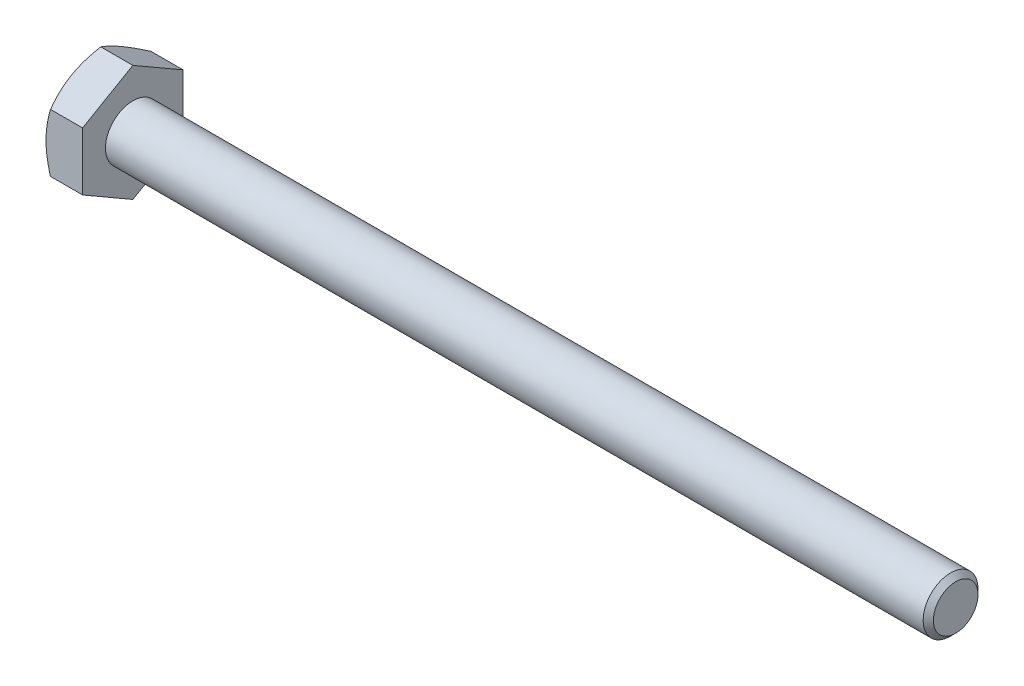
ISO-10303-21;
HEADER;
FILE_DESCRIPTION(('STEP AP214'),'2;1');
FILE_NAME('part.step','',(''),(''),'','','');
FILE_SCHEMA(('AUTOMOTIVE_DESIGN { 1 0 10303 214 1 1 1 1 }'));
ENDSEC;
DATA;
#1=APPLICATION_CONTEXT('core data for automotive mechanical design processes');
#2=APPLICATION_PROTOCOL_DEFINITION('international standard','automotive_design',2000,#1);
#3=PRODUCT_CONTEXT('',#1,'mechanical');
#4=PRODUCT('Part','Part','',(#3));
#5=PRODUCT_RELATED_PRODUCT_CATEGORY('part','',(#4));
#6=PRODUCT_DEFINITION_FORMATION('','',#4);
#7=PRODUCT_DEFINITION_CONTEXT('part definition',#1,'design');
#8=PRODUCT_DEFINITION('design','',#6,#7);
#9=PRODUCT_DEFINITION_SHAPE('','',#8);
#10=(LENGTH_UNIT() NAMED_UNIT(*) SI_UNIT(.MILLI.,.METRE.));
#11=(NAMED_UNIT(*) PLANE_ANGLE_UNIT() SI_UNIT($,.RADIAN.));
#12=(NAMED_UNIT(*) SI_UNIT($,.STERADIAN.) SOLID_ANGLE_UNIT());
#13=UNCERTAINTY_MEASURE_WITH_UNIT(LENGTH_MEASURE(1.E-05),#10,'distance_accuracy_value','');
#14=(GEOMETRIC_REPRESENTATION_CONTEXT(3) GLOBAL_UNCERTAINTY_ASSIGNED_CONTEXT((#13)) GLOBAL_UNIT_ASSIGNED_CONTEXT((#10,
#11,#12)) REPRESENTATION_CONTEXT('',''));
#15=CARTESIAN_POINT('',(0.,0.,0.));
#16=DIRECTION('',(0.,0.,1.));
#17=DIRECTION('',(1.,0.,0.));
#18=AXIS2_PLACEMENT_3D('',#15,#16,#17);
#19=CARTESIAN_POINT('',(0.247093813584343,0.,0.));
#20=DIRECTION('',(1.,0.,0.));
#21=DIRECTION('',(0.,0.,-1.));
#22=AXIS2_PLACEMENT_3D('',#19,#20,#21);
#23=CONICAL_SURFACE('',#22,3.17797903937844,1.04719755121946);
#24=CARTESIAN_POINT('',(0.24562010267378,1.58771322360887,2.75000002886048));
#25=CARTESIAN_POINT('',(0.208302603654191,1.65233281555866,2.63807561243907));
#26=CARTESIAN_POINT('',(0.174113259321967,1.7174699044324,2.52525486505261));
#27=CARTESIAN_POINT('',(0.113820966108115,1.8483182591926,2.29861886652116));
#28=CARTESIAN_POINT('',(0.087678031758483,1.91402496097017,2.18481152064462));
#29=CARTESIAN_POINT('',(0.0555789468438281,2.01320512545803,2.01302643664861));
#30=CARTESIAN_POINT('',(0.046061241370184,2.04639046606418,1.95554774065228));
#31=CARTESIAN_POINT('',(0.0295858947880669,2.1129200190349,1.84031517470215));
#32=CARTESIAN_POINT('',(0.0226281862985192,2.14626422719456,1.78256131203147));
#33=CARTESIAN_POINT('',(0.0113950805088262,2.2132348513754,1.66656478833565));
#34=CARTESIAN_POINT('',(0.00713332390408386,2.24686184378969,1.60832112896836));
#35=CARTESIAN_POINT('',(0.00142988482438796,2.31418196202442,1.49171926381427));
#36=CARTESIAN_POINT('',(-1.12391437539125E-05,2.34787509962031,1.43336103763178));
#37=CARTESIAN_POINT('',(4.72581289227276E-12,2.3815698604072,1.375));
#38=B_SPLINE_CURVE_WITH_KNOTS('',3,(#24,#25,#26,#27,#28,#29,#30,#31,#32,#33,#34,#35,#36,#37),
.UNSPECIFIED.,.F.,.F.,(4,2,2,2,2,2,4),(0.,0.403720170813952,0.805400455121433,1.00650414154214,
1.20760253438159,1.40971045256613,1.61185838561563),.UNSPECIFIED.);
#39=CARTESIAN_POINT('',(0.2456200978637,1.58771323194017,2.75000001443024));
#40=VERTEX_POINT('',#39);
#41=CARTESIAN_POINT('',(2.3630159899092E-12,2.38156986040366,1.37499999999796));
#42=VERTEX_POINT('',#41);
#43=EDGE_CURVE('E97',#40,#42,#38,.T.);
#44=ORIENTED_EDGE('',*,*,#43,.T.);
#45=CARTESIAN_POINT('',(0.,0.,0.));
#46=DIRECTION('',(1.,0.,0.));
#47=DIRECTION('',(0.,0.,-1.));
#48=AXIS2_PLACEMENT_3D('',#45,#46,#47);
#49=CIRCLE('',#48,2.74999999999181);
#50=CARTESIAN_POINT('',(2.36282788152752E-12,0.,2.74999999999591));
#51=VERTEX_POINT('',#50);
#52=EDGE_CURVE('E99',#42,#51,#49,.T.);
#53=ORIENTED_EDGE('',*,*,#52,.T.);
#54=CARTESIAN_POINT('',(4.72565576305503E-12,0.,2.75));
#55=CARTESIAN_POINT('',(-1.12391403169157E-05,0.0673895163245459,2.75));
#56=CARTESIAN_POINT('',(0.00142988460167275,0.134775786268303,2.75));
#57=CARTESIAN_POINT('',(0.00713332279565177,0.269416012274256,2.75));
#58=CARTESIAN_POINT('',(0.0113950787410856,0.336669991887335,2.75));
#59=CARTESIAN_POINT('',(0.022628182811776,0.470611229931942,2.75));
#60=CARTESIAN_POINT('',(0.029585890245106,0.537299641149282,2.75));
#61=CARTESIAN_POINT('',(0.0460612343572212,0.670358736954085,2.75));
#62=CARTESIAN_POINT('',(0.0555789384170422,0.736729413131717,2.75));
#63=CARTESIAN_POINT('',(0.0876780186410727,0.935089727173002,2.75));
#64=CARTESIAN_POINT('',(0.113820949258707,1.06650312094462,2.75));
#65=CARTESIAN_POINT('',(0.174113234142275,1.32819981107932,2.75));
#66=CARTESIAN_POINT('',(0.20830257386764,1.45847397922719,2.75));
#67=CARTESIAN_POINT('',(0.245620068055921,1.58771315367689,2.75));
#68=B_SPLINE_CURVE_WITH_KNOTS('',3,(#54,#55,#56,#57,#58,#59,#60,#61,#62,#63,#64,#65,#66,#67),
.UNSPECIFIED.,.F.,.F.,(4,2,2,2,2,2,4),(0.,0.202147917307363,0.404255819765089,0.60535419706349,
0.806457867940412,1.2081381213207,1.61185826082873),.UNSPECIFIED.);
#69=EDGE_CURVE('E20',#51,#40,#68,.T.);
#70=ORIENTED_EDGE('',*,*,#69,.T.);
#71=EDGE_LOOP('',(#44,#53,#70));
#72=FACE_BOUND('',#71,.T.);
#73=ADVANCED_FACE('F16',(#72),#23,.T.);
#74=CARTESIAN_POINT('',(0.247093813584343,0.,0.));
#75=DIRECTION('',(1.,0.,0.));
#76=DIRECTION('',(0.,0.,-1.));
#77=AXIS2_PLACEMENT_3D('',#74,#75,#76);
#78=CONICAL_SURFACE('',#77,3.17797903937844,1.04719755121946);
#79=CARTESIAN_POINT('',(0.,0.,0.));
#80=DIRECTION('',(1.,0.,0.));
#81=DIRECTION('',(0.,0.,-1.));
#82=AXIS2_PLACEMENT_3D('',#79,#80,#81);
#83=CIRCLE('',#82,2.74999999999181);
#84=CARTESIAN_POINT('',(2.36464317833425E-12,-2.38156986040366,1.37499999999796));
#85=VERTEX_POINT('',#84);
#86=EDGE_CURVE('E105',#51,#85,#83,.T.);
#87=ORIENTED_EDGE('',*,*,#86,.T.);
#88=CARTESIAN_POINT('',(4.72922376022689E-12,-2.38156986040721,1.37500000000001));
#89=CARTESIAN_POINT('',(-1.12391437503857E-05,-2.34787509962045,1.43336103763155));
#90=CARTESIAN_POINT('',(0.0014298848243798,-2.3141819620247,1.4917192638138));
#91=CARTESIAN_POINT('',(0.00713332390402984,-2.24686184379024,1.60832112896742));
#92=CARTESIAN_POINT('',(0.011395080508738,-2.21323485137609,1.66656478833447));
#93=CARTESIAN_POINT('',(0.0226281862983418,-2.14626422719551,1.78256131202983));
#94=CARTESIAN_POINT('',(0.0295858947878346,-2.11292001903599,1.84031517470028));
#95=CARTESIAN_POINT('',(0.0460612413698236,-2.04639046606553,1.95554774064996));
#96=CARTESIAN_POINT('',(0.0555789468433946,-2.01320512545951,2.01302643664606));
#97=CARTESIAN_POINT('',(0.0876780317578065,-1.91402496097204,2.1848115206414));
#98=CARTESIAN_POINT('',(0.113820966107245,-1.84831825919471,2.2986188665175));
#99=CARTESIAN_POINT('',(0.174113259320664,-1.71746990443502,2.52525486504808));
#100=CARTESIAN_POINT('',(0.208302603652649,-1.65233281556153,2.63807561243411));
#101=CARTESIAN_POINT('',(0.245620102671988,-1.58771322361198,2.75000002885509));
#102=B_SPLINE_CURVE_WITH_KNOTS('',3,(#88,#89,#90,#91,#92,#93,#94,#95,#96,#97,#98,#99,#100,#101),
.UNSPECIFIED.,.F.,.F.,(4,2,2,2,2,2,4),(0.,0.202147933048678,0.404255851232406,0.60535424407105,
0.806457930490951,1.20813821479683,1.61185838560916),.UNSPECIFIED.);
#103=CARTESIAN_POINT('',(0.245620080547694,-1.58771319694967,2.75));
#104=VERTEX_POINT('',#103);
#105=EDGE_CURVE('E113',#85,#104,#102,.T.);
#106=ORIENTED_EDGE('',*,*,#105,.T.);
#107=CARTESIAN_POINT('',(0.245620068041765,-1.58771315362786,2.75));
#108=CARTESIAN_POINT('',(0.20830257385546,-1.45847397918202,2.75));
#109=CARTESIAN_POINT('',(0.174113234131979,-1.32819981103807,2.75));
#110=CARTESIAN_POINT('',(0.113820949251817,-1.0665031209113,2.75));
#111=CARTESIAN_POINT('',(0.0876780186357089,-0.935089727143683,2.75));
#112=CARTESIAN_POINT('',(0.0555789384135963,-0.736729413108504,2.75));
#113=CARTESIAN_POINT('',(0.0460612343543534,-0.670358736932932,2.75));
#114=CARTESIAN_POINT('',(0.0295858902432482,-0.537299641132273,2.75));
#115=CARTESIAN_POINT('',(0.0226281828103503,-0.470611229917019,2.75));
#116=CARTESIAN_POINT('',(0.0113950787403629,-0.336669991876632,2.75));
#117=CARTESIAN_POINT('',(0.00713332279519862,-0.269416012265686,2.75));
#118=CARTESIAN_POINT('',(0.00142988460158163,-0.134775786264011,2.75));
#119=CARTESIAN_POINT('',(-1.12391403156188E-05,-0.0673895163223995,2.75));
#120=CARTESIAN_POINT('',(4.72564427270851E-12,0.,2.75));
#121=B_SPLINE_CURVE_WITH_KNOTS('',3,(#107,#108,#109,#110,#111,#112,#113,#114,#115,#116,#117,
#118,#119,#120),.UNSPECIFIED.,.F.,.F.,(4,2,2,2,2,2,4),(0.,0.403720139495227,0.805400392862871,
1.00650406373344,1.20760244102548,1.40971034347678,1.6118582607777),.UNSPECIFIED.);
#122=EDGE_CURVE('E92',#104,#51,#121,.T.);
#123=ORIENTED_EDGE('',*,*,#122,.T.);
#124=EDGE_LOOP('',(#87,#106,#123));
#125=FACE_BOUND('',#124,.T.);
#126=ADVANCED_FACE('F111',(#125),#78,.T.);
#127=CARTESIAN_POINT('',(0.247093813584343,0.,0.));
#128=DIRECTION('',(1.,0.,0.));
#129=DIRECTION('',(0.,0.,-1.));
#130=AXIS2_PLACEMENT_3D('',#127,#128,#129);
#131=CONICAL_SURFACE('',#130,3.17797903937844,1.04719755121946);
#132=CARTESIAN_POINT('',(0.,0.,0.));
#133=DIRECTION('',(1.,0.,0.));
#134=DIRECTION('',(0.,0.,-1.));
#135=AXIS2_PLACEMENT_3D('',#132,#133,#134);
#136=CIRCLE('',#135,2.74999999999181);
#137=CARTESIAN_POINT('',(2.36464430188982E-12,-2.38156986040366,-1.37499999999796));
#138=VERTEX_POINT('',#137);
#139=EDGE_CURVE('E119',#85,#138,#136,.T.);
#140=ORIENTED_EDGE('',*,*,#139,.T.);
#141=CARTESIAN_POINT('',(4.72928860377965E-12,-2.38156986040721,-1.37500000000001));
#142=CARTESIAN_POINT('',(-1.12391437501949E-05,-2.41526462119399,-1.31663896236842));
#143=CARTESIAN_POINT('',(0.00142988482438192,-2.44895775878977,-1.25828073618613));
#144=CARTESIAN_POINT('',(0.00713332390403964,-2.51627787702427,-1.14167887103242));
#145=CARTESIAN_POINT('',(0.0113950805087536,-2.54990486943845,-1.08343521166534));
#146=CARTESIAN_POINT('',(0.0226281862983728,-2.61687549361907,-0.967438687969894));
#147=CARTESIAN_POINT('',(0.0295858947878753,-2.65021970177862,-0.909684825299408));
#148=CARTESIAN_POINT('',(0.0460612413698864,-2.71674925474912,-0.794452259349648));
#149=CARTESIAN_POINT('',(0.0555789468434698,-2.74993459535516,-0.736973563353507));
#150=CARTESIAN_POINT('',(0.0876780317579234,-2.8491147598427,-0.565188479358052));
#151=CARTESIAN_POINT('',(0.113820966107395,-2.91482146162007,-0.451381133481875));
#152=CARTESIAN_POINT('',(0.17411325932089,-3.04566981637985,-0.224745134951144));
#153=CARTESIAN_POINT('',(0.208302603652916,-3.11080690525339,-0.111924387565041));
#154=CARTESIAN_POINT('',(0.245620102672298,-3.17542649720298,2.88560130651261E-08));
#155=B_SPLINE_CURVE_WITH_KNOTS('',3,(#141,#142,#143,#144,#145,#146,#147,#148,#149,#150,#151,
#152,#153,#154),.UNSPECIFIED.,.F.,.F.,(4,2,2,2,2,2,4),(0.,0.202147933048819,0.404255851232687,
0.605354244071471,0.806457930491512,1.20813821479767,1.61185838561028),.UNSPECIFIED.);
#156=CARTESIAN_POINT('',(0.245620080547544,-3.17542645888178,3.75182486861286E-08));
#157=VERTEX_POINT('',#156);
#158=EDGE_CURVE('E173',#138,#157,#155,.T.);
#159=ORIENTED_EDGE('',*,*,#158,.T.);
#160=CARTESIAN_POINT('',(0.245620068041461,-3.17542643722061,7.50364969385818E-08));
#161=CARTESIAN_POINT('',(0.208302573855199,-3.11080684999773,0.111924483270649));
#162=CARTESIAN_POINT('',(0.174113234131759,-3.0456697659258,0.224745222340119));
#163=CARTESIAN_POINT('',(0.11382094925167,-2.9148214208625,0.451381204076056));
#164=CARTESIAN_POINT('',(0.0876780186355958,-2.84911472397873,0.565188541476268));
#165=CARTESIAN_POINT('',(0.0555789384135252,-2.74993456696121,0.736973612533276));
#166=CARTESIAN_POINT('',(0.0460612343542949,-2.71674922887345,0.794452304167634));
#167=CARTESIAN_POINT('',(0.0295858902432116,-2.65021968097316,0.909684861335514));
#168=CARTESIAN_POINT('',(0.0226281828103228,-2.61687547536556,0.967438719585908));
#169=CARTESIAN_POINT('',(0.0113950787403507,-2.54990485634541,1.08343523434314));
#170=CARTESIAN_POINT('',(0.00713332279519246,-2.51627786653996,1.14167888919178));
#171=CARTESIAN_POINT('',(0.0014298846015836,-2.44895775353917,1.25828074528043));
#172=CARTESIAN_POINT('',(-1.12391403115827E-05,-2.41526461856839,1.3166389669161));
#173=CARTESIAN_POINT('',(4.72934450508175E-12,-2.38156986040721,1.37500000000001));
#174=B_SPLINE_CURVE_WITH_KNOTS('',3,(#160,#161,#162,#163,#164,#165,#166,#167,#168,#169,#170,
#171,#172,#173),.UNSPECIFIED.,.F.,.F.,(4,2,2,2,2,2,4),(0.,0.40372013949495,0.805400392862319,
1.00650406373275,1.20760244102465,1.40971034347581,1.6118582607766),.UNSPECIFIED.);
#175=EDGE_CURVE('E191',#157,#85,#174,.T.);
#176=ORIENTED_EDGE('',*,*,#175,.T.);
#177=EDGE_LOOP('',(#140,#159,#176));
#178=FACE_BOUND('',#177,.T.);
#179=ADVANCED_FACE('F156',(#178),#131,.T.);
#180=CARTESIAN_POINT('',(0.247093813584343,0.,0.));
#181=DIRECTION('',(1.,0.,0.));
#182=DIRECTION('',(0.,0.,-1.));
#183=AXIS2_PLACEMENT_3D('',#180,#181,#182);
#184=CONICAL_SURFACE('',#183,3.17797903937844,1.04719755121946);
#185=CARTESIAN_POINT('',(0.,0.,0.));
#186=DIRECTION('',(1.,0.,0.));
#187=DIRECTION('',(0.,0.,-1.));
#188=AXIS2_PLACEMENT_3D('',#185,#186,#187);
#189=CIRCLE('',#188,2.74999999999181);
#190=CARTESIAN_POINT('',(2.36301567085236E-12,0.,-2.74999999999591));
#191=VERTEX_POINT('',#190);
#192=EDGE_CURVE('E121',#138,#191,#189,.T.);
#193=ORIENTED_EDGE('',*,*,#192,.T.);
#194=CARTESIAN_POINT('',(4.72603134170472E-12,0.,-2.75));
#195=CARTESIAN_POINT('',(-1.12391437535286E-05,-0.0673895215734155,-2.75));
#196=CARTESIAN_POINT('',(0.00142988482437251,-0.134775796764826,-2.75));
#197=CARTESIAN_POINT('',(0.00713332390400646,-0.269416033233554,-2.75));
#198=CARTESIAN_POINT('',(0.0113950805087027,-0.336670018061767,-2.75));
#199=CARTESIAN_POINT('',(0.0226281862982756,-0.470611266422736,-2.75));
#200=CARTESIAN_POINT('',(0.0295858947877495,-0.537299682741689,-2.75));
#201=CARTESIAN_POINT('',(0.0460612413696938,-0.670358788682425,-2.75));
#202=CARTESIAN_POINT('',(0.055578946843239,-0.73672946989437,-2.75));
#203=CARTESIAN_POINT('',(0.0876780317575655,-0.935089798869043,-2.75));
#204=CARTESIAN_POINT('',(0.113820966106936,-1.06650320242351,-2.75));
#205=CARTESIAN_POINT('',(0.174113259320205,-1.32819991194254,-2.75));
#206=CARTESIAN_POINT('',(0.208302603652107,-1.45847408968937,-2.75));
#207=CARTESIAN_POINT('',(0.245620102671358,-1.58771327358829,-2.75));
#208=B_SPLINE_CURVE_WITH_KNOTS('',3,(#194,#195,#196,#197,#198,#199,#200,#201,#202,#203,#204,
#205,#206,#207),.UNSPECIFIED.,.F.,.F.,(4,2,2,2,2,2,4),(0.,0.202147933048393,0.404255851231836,
0.605354244070199,0.806457930489819,1.20813821479514,1.6118583856069),.UNSPECIFIED.);
#209=CARTESIAN_POINT('',(0.245620080548032,-1.58771326193192,-2.74999996248315));
#210=VERTEX_POINT('',#209);
#211=EDGE_CURVE('E160',#191,#210,#208,.T.);
#212=ORIENTED_EDGE('',*,*,#211,.T.);
#213=CARTESIAN_POINT('',(0.245620068042392,-1.5877132835922,-2.74999992496631));
#214=CARTESIAN_POINT('',(0.208302573856,-1.6523328708152,-2.63807551673193));
#215=CARTESIAN_POINT('',(0.174113234132436,-1.71746995488726,-2.52525477766224));
#216=CARTESIAN_POINT('',(0.113820949252124,-1.84831829995082,-2.29861879592585));
#217=CARTESIAN_POINT('',(0.0876780186359484,-1.91402499683472,-2.18481145852541));
#218=CARTESIAN_POINT('',(0.0555789384137517,-2.01320515385245,-2.01302638746806));
#219=CARTESIAN_POINT('',(0.0460612343544835,-2.04639049194028,-1.95554769583358));
#220=CARTESIAN_POINT('',(0.0295858902433337,-2.1129200398407,-1.84031513866546));
#221=CARTESIAN_POINT('',(0.0226281828104164,-2.14626424544837,-1.78256128041495));
#222=CARTESIAN_POINT('',(0.0113950787403979,-2.21323486446866,-1.66656476565748));
#223=CARTESIAN_POINT('',(0.00713332279522201,-2.24686185427418,-1.60832111080872));
#224=CARTESIAN_POINT('',(0.00142988460158942,-2.31418196727511,-1.49171925471982));
#225=CARTESIAN_POINT('',(-1.12391403117872E-05,-2.34787510224596,-1.43336103308403));
#226=CARTESIAN_POINT('',(4.72923002787203E-12,-2.38156986040721,-1.375));
#227=B_SPLINE_CURVE_WITH_KNOTS('',3,(#213,#214,#215,#216,#217,#218,#219,#220,#221,#222,#223,
#224,#225,#226),.UNSPECIFIED.,.F.,.F.,(4,2,2,2,2,2,4),(0.,0.403720139495791,0.805400392863992,
1.00650406373484,1.20760244102716,1.40971034347874,1.61185826077995),.UNSPECIFIED.);
#228=EDGE_CURVE('E166',#210,#138,#227,.T.);
#229=ORIENTED_EDGE('',*,*,#228,.T.);
#230=EDGE_LOOP('',(#193,#212,#229));
#231=FACE_BOUND('',#230,.T.);
#232=ADVANCED_FACE('F149',(#231),#184,.T.);
#233=CARTESIAN_POINT('',(0.247093813584343,0.,0.));
#234=DIRECTION('',(1.,0.,0.));
#235=DIRECTION('',(0.,0.,-1.));
#236=AXIS2_PLACEMENT_3D('',#233,#234,#235);
#237=CONICAL_SURFACE('',#236,3.17797903937844,1.04719755121946);
#238=CARTESIAN_POINT('',(0.245620102671646,1.58771327358929,-2.75));
#239=CARTESIAN_POINT('',(0.208302603652355,1.45847408969029,-2.75));
#240=CARTESIAN_POINT('',(0.174113259320415,1.32819991194339,-2.75));
#241=CARTESIAN_POINT('',(0.113820966107077,1.06650320242419,-2.75));
#242=CARTESIAN_POINT('',(0.0876780317576748,0.935089798869642,-2.75));
#243=CARTESIAN_POINT('',(0.0555789468433089,0.736729469894844,-2.75));
#244=CARTESIAN_POINT('',(0.046061241369752,0.670358788682857,-2.75));
#245=CARTESIAN_POINT('',(0.029585894787787,0.537299682742037,-2.75));
#246=CARTESIAN_POINT('',(0.0226281862983043,0.470611266423041,-2.75));
#247=CARTESIAN_POINT('',(0.0113950805087172,0.336670018061985,-2.75));
#248=CARTESIAN_POINT('',(0.00713332390401551,0.269416033233729,-2.75));
#249=CARTESIAN_POINT('',(0.00142988482437428,0.134775796764914,-2.75));
#250=CARTESIAN_POINT('',(-1.12391437535898E-05,0.0673895215734597,-2.75));
#251=CARTESIAN_POINT('',(4.72603085714641E-12,0.,-2.75));
#252=B_SPLINE_CURVE_WITH_KNOTS('',3,(#238,#239,#240,#241,#242,#243,#244,#245,#246,#247,#248,
#249,#250,#251),.UNSPECIFIED.,.F.,.F.,(4,2,2,2,2,2,4),(0.,0.403720170812023,0.805400455117598,
1.00650414153735,1.20760253437584,1.40971045255941,1.61185838560794),.UNSPECIFIED.);
#253=CARTESIAN_POINT('',(0.245620097862634,1.58771325693038,-2.75));
#254=VERTEX_POINT('',#253);
#255=EDGE_CURVE('E106',#254,#191,#252,.T.);
#256=ORIENTED_EDGE('',*,*,#255,.T.);
#257=CARTESIAN_POINT('',(0.,0.,0.));
#258=DIRECTION('',(1.,0.,0.));
#259=DIRECTION('',(0.,0.,-1.));
#260=AXIS2_PLACEMENT_3D('',#257,#258,#259);
#261=CIRCLE('',#260,2.74999999999181);
#262=CARTESIAN_POINT('',(2.36298517466423E-12,2.38156986040366,-1.37499999999796));
#263=VERTEX_POINT('',#262);
#264=EDGE_CURVE('E341',#191,#263,#261,.T.);
#265=ORIENTED_EDGE('',*,*,#264,.T.);
#266=CARTESIAN_POINT('',(4.72615813865329E-12,2.3815698604072,-1.375));
#267=CARTESIAN_POINT('',(-1.12391403149998E-05,2.34787510224598,-1.43336103308399));
#268=CARTESIAN_POINT('',(0.00142988460158435,2.31418196727515,-1.49171925471975));
#269=CARTESIAN_POINT('',(0.00713332279520972,2.24686185427426,-1.60832111080856));
#270=CARTESIAN_POINT('',(0.0113950787403803,2.21323486446876,-1.66656476565729));
#271=CARTESIAN_POINT('',(0.0226281828103846,2.14626424544852,-1.78256128041469));
#272=CARTESIAN_POINT('',(0.0295858902432931,2.11292003984086,-1.84031513866517));
#273=CARTESIAN_POINT('',(0.0460612343544224,2.04639049194049,-1.95554769583321));
#274=CARTESIAN_POINT('',(0.055578938413679,2.01320515385268,-2.01302638746765));
#275=CARTESIAN_POINT('',(0.0876780186358369,1.91402499683501,-2.1848114585249));
#276=CARTESIAN_POINT('',(0.113820949251981,1.84831829995116,-2.29861879592527));
#277=CARTESIAN_POINT('',(0.174113234132225,1.71746995488768,-2.52525477766152));
#278=CARTESIAN_POINT('',(0.208302573855751,1.65233287081565,-2.63807551673114));
#279=CARTESIAN_POINT('',(0.245620068042103,1.58771328359269,-2.74999992496544));
#280=B_SPLINE_CURVE_WITH_KNOTS('',3,(#266,#267,#268,#269,#270,#271,#272,#273,#274,#275,#276,
#277,#278,#279),.UNSPECIFIED.,.F.,.F.,(4,2,2,2,2,2,4),(0.,0.202147917301079,0.404255819752529,
0.605354197044726,0.806457867915443,1.20813812128339,1.61185826077892),.UNSPECIFIED.);
#281=EDGE_CURVE('E133',#263,#254,#280,.T.);
#282=ORIENTED_EDGE('',*,*,#281,.T.);
#283=EDGE_LOOP('',(#256,#265,#282));
#284=FACE_BOUND('',#283,.T.);
#285=ADVANCED_FACE('F144',(#284),#237,.T.);
#286=CARTESIAN_POINT('',(0.,3.17542648054294,0.));
#287=DIRECTION('',(1.,0.,0.));
#288=DIRECTION('',(0.,0.,-1.));
#289=AXIS2_PLACEMENT_3D('',#286,#287,#288);
#290=PLANE('',#289);
#291=ORIENTED_EDGE('',*,*,#192,.F.);
#292=ORIENTED_EDGE('',*,*,#139,.F.);
#293=ORIENTED_EDGE('',*,*,#86,.F.);
#294=ORIENTED_EDGE('',*,*,#52,.F.);
#295=CARTESIAN_POINT('',(0.,0.,0.));
#296=DIRECTION('',(1.,0.,0.));
#297=DIRECTION('',(0.,0.,-1.));
#298=AXIS2_PLACEMENT_3D('',#295,#296,#297);
#299=CIRCLE('',#298,2.74999999999181);
#300=EDGE_CURVE('E342',#263,#42,#299,.T.);
#301=ORIENTED_EDGE('',*,*,#300,.F.);
#302=ORIENTED_EDGE('',*,*,#264,.F.);
#303=EDGE_LOOP('',(#291,#292,#293,#294,#301,#302));
#304=FACE_BOUND('',#303,.T.);
#305=ADVANCED_FACE('F117',(#304),#290,.F.);
#306=CARTESIAN_POINT('',(0.247093813584343,0.,0.));
#307=DIRECTION('',(1.,0.,0.));
#308=DIRECTION('',(0.,0.,-1.));
#309=AXIS2_PLACEMENT_3D('',#306,#307,#308);
#310=CONICAL_SURFACE('',#309,3.17797903937844,1.04719755121946);
#311=CARTESIAN_POINT('',(0.245620093054257,3.17542648054404,1.90076577879672E-12));
#312=CARTESIAN_POINT('',(0.208302595377179,3.1108068899072,-0.111924414145401));
#313=CARTESIAN_POINT('',(0.174113252325098,3.04566980236722,-0.224745159221722));
#314=CARTESIAN_POINT('',(0.113820961426044,2.91482145030045,-0.451381153088027));
#315=CARTESIAN_POINT('',(0.0876780281134501,2.84911474988218,-0.565188496610171));
#316=CARTESIAN_POINT('',(0.0555789445022141,2.74993458746929,-0.736973577012226));
#317=CARTESIAN_POINT('',(0.0460612394214395,2.71674924756265,-0.794452271796967));
#318=CARTESIAN_POINT('',(0.0295858935256803,2.6502196960003,-0.909684835307731));
#319=CARTESIAN_POINT('',(0.0226281853296317,2.61687548854951,-0.967438696750622));
#320=CARTESIAN_POINT('',(0.0113950800176109,2.54990486580211,-1.08343521796365));
#321=CARTESIAN_POINT('',(0.00713332359607554,2.51627787411245,-1.14167887607583));
#322=CARTESIAN_POINT('',(0.00142988476250048,2.44895775733151,-1.25828073871189));
#323=CARTESIAN_POINT('',(-1.12391427987271E-05,2.41526462046477,-1.31663896363145));
#324=CARTESIAN_POINT('',(4.72607735642762E-12,2.3815698604072,-1.375));
#325=B_SPLINE_CURVE_WITH_KNOTS('',3,(#311,#312,#313,#314,#315,#316,#317,#318,#319,#320,#321,
#322,#323,#324),.UNSPECIFIED.,.F.,.F.,(4,2,2,2,2,2,4),(0.,0.403720162114742,0.805400437828253,
1.00650411992969,1.20760250845064,1.40971042226505,1.61185835094016),.UNSPECIFIED.);
#326=CARTESIAN_POINT('',(0.245620093054257,3.17542648054404,0.));
#327=VERTEX_POINT('',#326);
#328=EDGE_CURVE('E256',#327,#263,#325,.T.);
#329=ORIENTED_EDGE('',*,*,#328,.T.);
#330=ORIENTED_EDGE('',*,*,#300,.T.);
#331=CARTESIAN_POINT('',(4.7258761186801E-12,2.3815698604072,1.375));
#332=CARTESIAN_POINT('',(-1.12391427987737E-05,2.41526462046477,1.31663896363145));
#333=CARTESIAN_POINT('',(0.00142988476250046,2.44895775733151,1.25828073871189));
#334=CARTESIAN_POINT('',(0.00713332359607553,2.51627787411245,1.14167887607583));
#335=CARTESIAN_POINT('',(0.0113950800176108,2.54990486580211,1.08343521796365));
#336=CARTESIAN_POINT('',(0.0226281853296318,2.61687548854951,0.967438696750622));
#337=CARTESIAN_POINT('',(0.0295858935256804,2.6502196960003,0.90968483530773));
#338=CARTESIAN_POINT('',(0.0460612394214397,2.71674924756265,0.794452271796966));
#339=CARTESIAN_POINT('',(0.0555789445022143,2.74993458746929,0.736973577012225));
#340=CARTESIAN_POINT('',(0.0876780281134504,2.84911474988218,0.565188496610171));
#341=CARTESIAN_POINT('',(0.113820961426044,2.91482145030045,0.451381153088027));
#342=CARTESIAN_POINT('',(0.174113252325097,3.04566980236722,0.224745159221722));
#343=CARTESIAN_POINT('',(0.208302595377179,3.11080688990721,0.111924414145401));
#344=CARTESIAN_POINT('',(0.245620093054257,3.17542648054404,-1.90066565217538E-12));
#345=B_SPLINE_CURVE_WITH_KNOTS('',3,(#331,#332,#333,#334,#335,#336,#337,#338,#339,#340,#341,
#342,#343,#344),.UNSPECIFIED.,.F.,.F.,(4,2,2,2,2,2,4),(0.,0.202147928675111,0.404255842489526,
0.605354231010469,0.806457913111909,1.20813818882542,1.61185835094016),.UNSPECIFIED.);
#346=EDGE_CURVE('E249',#42,#327,#345,.T.);
#347=ORIENTED_EDGE('',*,*,#346,.T.);
#348=EDGE_LOOP('',(#329,#330,#347));
#349=FACE_BOUND('',#348,.T.);
#350=ADVANCED_FACE('F264',(#349),#310,.T.);
#351=CARTESIAN_POINT('',(47.,0.,0.));
#352=DIRECTION('',(-1.,0.,0.));
#353=DIRECTION('',(0.,0.,1.));
#354=AXIS2_PLACEMENT_3D('',#351,#352,#353);
#355=PLANE('',#354);
#356=CARTESIAN_POINT('',(47.0000000000255,0.,0.));
#357=DIRECTION('',(-1.,0.,0.));
#358=DIRECTION('',(0.,0.,1.));
#359=AXIS2_PLACEMENT_3D('',#356,#357,#358);
#360=CIRCLE('',#359,1.2194999999906);
#361=CARTESIAN_POINT('',(47.0000000000255,0.,1.2194999999906));
#362=VERTEX_POINT('',#361);
#363=EDGE_CURVE('E237',#362,#362,#360,.T.);
#364=ORIENTED_EDGE('',*,*,#363,.F.);
#365=EDGE_LOOP('',(#364));
#366=FACE_BOUND('',#365,.T.);
#367=ADVANCED_FACE('F268',(#366),#355,.F.);
#368=CARTESIAN_POINT('',(2.,1.58771324027147,-2.75));
#369=DIRECTION('',(0.,-0.866025403784438,0.500000000000001));
#370=DIRECTION('',(0.,-0.500000000000001,-0.866025403784438));
#371=AXIS2_PLACEMENT_3D('',#368,#369,#370);
#372=PLANE('',#371);
#373=DIRECTION('',(1.,0.,0.));
#374=VECTOR('',#373,1.);
#375=CARTESIAN_POINT('',(2.,3.17542648054294,0.));
#376=LINE('',#375,#374);
#377=CARTESIAN_POINT('',(2.,3.17542648054294,0.));
#378=VERTEX_POINT('',#377);
#379=EDGE_CURVE('E255',#327,#378,#376,.T.);
#380=ORIENTED_EDGE('',*,*,#379,.T.);
#381=DIRECTION('',(0.,0.500000000000001,0.866025403784438));
#382=VECTOR('',#381,1.);
#383=CARTESIAN_POINT('',(2.,1.58771324027147,-2.75));
#384=LINE('',#383,#382);
#385=CARTESIAN_POINT('',(2.,1.58771324027147,-2.75));
#386=VERTEX_POINT('',#385);
#387=EDGE_CURVE('E239',#386,#378,#384,.T.);
#388=ORIENTED_EDGE('',*,*,#387,.F.);
#389=DIRECTION('',(1.,0.,0.));
#390=VECTOR('',#389,1.);
#391=CARTESIAN_POINT('',(2.,1.58771324027147,-2.75));
#392=LINE('',#391,#390);
#393=EDGE_CURVE('E240',#386,#254,#392,.F.);
#394=ORIENTED_EDGE('',*,*,#393,.T.);
#395=ORIENTED_EDGE('',*,*,#281,.F.);
#396=ORIENTED_EDGE('',*,*,#328,.F.);
#397=EDGE_LOOP('',(#380,#388,#394,#395,#396));
#398=FACE_BOUND('',#397,.T.);
#399=ADVANCED_FACE('F272',(#398),#372,.F.);
#400=CARTESIAN_POINT('',(2.,3.17542648054294,0.));
#401=DIRECTION('',(0.,-0.866025403784438,-0.500000000000001));
#402=DIRECTION('',(0.,0.500000000000001,-0.866025403784438));
#403=AXIS2_PLACEMENT_3D('',#400,#401,#402);
#404=PLANE('',#403);
#405=DIRECTION('',(1.,0.,0.));
#406=VECTOR('',#405,1.);
#407=CARTESIAN_POINT('',(2.,1.58771324027147,2.75));
#408=LINE('',#407,#406);
#409=CARTESIAN_POINT('',(2.,1.58771324027147,2.75));
#410=VERTEX_POINT('',#409);
#411=EDGE_CURVE('E95',#40,#410,#408,.T.);
#412=ORIENTED_EDGE('',*,*,#411,.T.);
#413=DIRECTION('',(0.,-0.500000000000001,0.866025403784438));
#414=VECTOR('',#413,1.);
#415=CARTESIAN_POINT('',(2.,3.17542648054294,0.));
#416=LINE('',#415,#414);
#417=EDGE_CURVE('E243',#378,#410,#416,.T.);
#418=ORIENTED_EDGE('',*,*,#417,.F.);
#419=ORIENTED_EDGE('',*,*,#379,.F.);
#420=ORIENTED_EDGE('',*,*,#346,.F.);
#421=ORIENTED_EDGE('',*,*,#43,.F.);
#422=EDGE_LOOP('',(#412,#418,#419,#420,#421));
#423=FACE_BOUND('',#422,.T.);
#424=ADVANCED_FACE('F262',(#423),#404,.F.);
#425=CARTESIAN_POINT('',(2.,1.58771324027147,2.75));
#426=DIRECTION('',(0.,0.,-1.));
#427=DIRECTION('',(0.,1.,0.));
#428=AXIS2_PLACEMENT_3D('',#425,#426,#427);
#429=PLANE('',#428);
#430=DIRECTION('',(1.,0.,0.));
#431=VECTOR('',#430,1.);
#432=CARTESIAN_POINT('',(2.,-1.58771324027148,2.75));
#433=LINE('',#432,#431);
#434=CARTESIAN_POINT('',(2.,-1.58771324027148,2.75));
#435=VERTEX_POINT('',#434);
#436=EDGE_CURVE('E317',#104,#435,#433,.T.);
#437=ORIENTED_EDGE('',*,*,#436,.T.);
#438=DIRECTION('',(0.,1.,0.));
#439=VECTOR('',#438,1.);
#440=CARTESIAN_POINT('',(2.,3.17542648054294,2.75));
#441=LINE('',#440,#439);
#442=EDGE_CURVE('E292',#410,#435,#441,.F.);
#443=ORIENTED_EDGE('',*,*,#442,.F.);
#444=ORIENTED_EDGE('',*,*,#411,.F.);
#445=ORIENTED_EDGE('',*,*,#69,.F.);
#446=ORIENTED_EDGE('',*,*,#122,.F.);
#447=EDGE_LOOP('',(#437,#443,#444,#445,#446));
#448=FACE_BOUND('',#447,.T.);
#449=ADVANCED_FACE('F90',(#448),#429,.F.);
#450=CARTESIAN_POINT('',(2.,-3.17542648054295,0.));
#451=DIRECTION('',(0.,0.866025403784438,-0.500000000000001));
#452=DIRECTION('',(0.,0.500000000000001,0.866025403784438));
#453=AXIS2_PLACEMENT_3D('',#450,#451,#452);
#454=PLANE('',#453);
#455=DIRECTION('',(1.,0.,0.));
#456=VECTOR('',#455,1.);
#457=CARTESIAN_POINT('',(2.,-3.17542648054295,0.));
#458=LINE('',#457,#456);
#459=CARTESIAN_POINT('',(2.,-3.17542648054295,0.));
#460=VERTEX_POINT('',#459);
#461=EDGE_CURVE('E318',#157,#460,#458,.T.);
#462=ORIENTED_EDGE('',*,*,#461,.T.);
#463=DIRECTION('',(0.,-0.500000000000001,-0.866025403784438));
#464=VECTOR('',#463,1.);
#465=CARTESIAN_POINT('',(2.,-1.58771324027148,2.75));
#466=LINE('',#465,#464);
#467=EDGE_CURVE('E301',#435,#460,#466,.T.);
#468=ORIENTED_EDGE('',*,*,#467,.F.);
#469=ORIENTED_EDGE('',*,*,#436,.F.);
#470=ORIENTED_EDGE('',*,*,#105,.F.);
#471=ORIENTED_EDGE('',*,*,#175,.F.);
#472=EDGE_LOOP('',(#462,#468,#469,#470,#471));
#473=FACE_BOUND('',#472,.T.);
#474=ADVANCED_FACE('F183',(#473),#454,.F.);
#475=CARTESIAN_POINT('',(2.,-1.58771324027148,-2.75));
#476=DIRECTION('',(0.,0.866025403784438,0.500000000000001));
#477=DIRECTION('',(0.,-0.500000000000001,0.866025403784438));
#478=AXIS2_PLACEMENT_3D('',#475,#476,#477);
#479=PLANE('',#478);
#480=DIRECTION('',(1.,0.,0.));
#481=VECTOR('',#480,1.);
#482=CARTESIAN_POINT('',(2.,-1.58771324027164,-2.75));
#483=LINE('',#482,#481);
#484=CARTESIAN_POINT('',(2.,-1.58771324027158,-2.75));
#485=VERTEX_POINT('',#484);
#486=EDGE_CURVE('E40',#210,#485,#483,.T.);
#487=ORIENTED_EDGE('',*,*,#486,.T.);
#488=DIRECTION('',(0.,0.500000000000001,-0.866025403784438));
#489=VECTOR('',#488,1.);
#490=CARTESIAN_POINT('',(2.,-3.17542648054295,0.));
#491=LINE('',#490,#489);
#492=EDGE_CURVE('E298',#460,#485,#491,.T.);
#493=ORIENTED_EDGE('',*,*,#492,.F.);
#494=ORIENTED_EDGE('',*,*,#461,.F.);
#495=ORIENTED_EDGE('',*,*,#158,.F.);
#496=ORIENTED_EDGE('',*,*,#228,.F.);
#497=EDGE_LOOP('',(#487,#493,#494,#495,#496));
#498=FACE_BOUND('',#497,.T.);
#499=ADVANCED_FACE('F179',(#498),#479,.F.);
#500=CARTESIAN_POINT('',(2.,1.58771324027147,-2.75));
#501=DIRECTION('',(0.,0.,1.));
#502=DIRECTION('',(0.,-1.,0.));
#503=AXIS2_PLACEMENT_3D('',#500,#501,#502);
#504=PLANE('',#503);
#505=ORIENTED_EDGE('',*,*,#393,.F.);
#506=DIRECTION('',(0.,1.,0.));
#507=VECTOR('',#506,1.);
#508=CARTESIAN_POINT('',(2.,3.17542648054294,-2.75));
#509=LINE('',#508,#507);
#510=EDGE_CURVE('E296',#485,#386,#509,.T.);
#511=ORIENTED_EDGE('',*,*,#510,.F.);
#512=ORIENTED_EDGE('',*,*,#486,.F.);
#513=ORIENTED_EDGE('',*,*,#211,.F.);
#514=ORIENTED_EDGE('',*,*,#255,.F.);
#515=EDGE_LOOP('',(#505,#511,#512,#513,#514));
#516=FACE_BOUND('',#515,.T.);
#517=ADVANCED_FACE('F140',(#516),#504,.F.);
#518=CARTESIAN_POINT('',(46.7195000000515,0.,0.));
#519=DIRECTION('',(-1.,0.,0.));
#520=DIRECTION('',(0.,0.,1.));
#521=AXIS2_PLACEMENT_3D('',#518,#519,#520);
#522=CONICAL_SURFACE('',#521,1.49999999996453,0.785398163397448);
#523=CARTESIAN_POINT('',(46.7195,0.,0.));
#524=DIRECTION('',(-1.,0.,0.));
#525=DIRECTION('',(0.,0.,1.));
#526=AXIS2_PLACEMENT_3D('',#523,#524,#525);
#527=CIRCLE('',#526,1.5);
#528=CARTESIAN_POINT('',(46.7195,0.,1.5));
#529=VERTEX_POINT('',#528);
#530=EDGE_CURVE('E31',#529,#529,#527,.T.);
#531=ORIENTED_EDGE('',*,*,#530,.F.);
#532=EDGE_LOOP('',(#531));
#533=FACE_BOUND('',#532,.T.);
#534=ORIENTED_EDGE('',*,*,#363,.T.);
#535=EDGE_LOOP('',(#534));
#536=FACE_BOUND('',#535,.T.);
#537=ADVANCED_FACE('F222',(#533,#536),#522,.T.);
#538=CARTESIAN_POINT('',(2.,3.17542648054294,0.));
#539=DIRECTION('',(1.,0.,0.));
#540=DIRECTION('',(0.,0.,-1.));
#541=AXIS2_PLACEMENT_3D('',#538,#539,#540);
#542=PLANE('',#541);
#543=CARTESIAN_POINT('',(2.,0.,0.));
#544=DIRECTION('',(-1.,0.,0.));
#545=DIRECTION('',(0.,0.,1.));
#546=AXIS2_PLACEMENT_3D('',#543,#544,#545);
#547=CIRCLE('',#546,1.5);
#548=CARTESIAN_POINT('',(2.,0.,1.5));
#549=VERTEX_POINT('',#548);
#550=EDGE_CURVE('E11',#549,#549,#547,.F.);
#551=ORIENTED_EDGE('',*,*,#550,.F.);
#552=EDGE_LOOP('',(#551));
#553=FACE_BOUND('',#552,.T.);
#554=ORIENTED_EDGE('',*,*,#492,.T.);
#555=ORIENTED_EDGE('',*,*,#510,.T.);
#556=ORIENTED_EDGE('',*,*,#387,.T.);
#557=ORIENTED_EDGE('',*,*,#417,.T.);
#558=ORIENTED_EDGE('',*,*,#442,.T.);
#559=ORIENTED_EDGE('',*,*,#467,.T.);
#560=EDGE_LOOP('',(#554,#555,#556,#557,#558,#559));
#561=FACE_BOUND('',#560,.T.);
#562=ADVANCED_FACE('F216',(#553,#561),#542,.T.);
#563=CARTESIAN_POINT('',(0.,0.,0.));
#564=DIRECTION('',(-1.,0.,0.));
#565=DIRECTION('',(0.,0.,1.));
#566=AXIS2_PLACEMENT_3D('',#563,#564,#565);
#567=CYLINDRICAL_SURFACE('',#566,1.5);
#568=ORIENTED_EDGE('',*,*,#550,.T.);
#569=EDGE_LOOP('',(#568));
#570=FACE_BOUND('',#569,.T.);
#571=ORIENTED_EDGE('',*,*,#530,.T.);
#572=EDGE_LOOP('',(#571));
#573=FACE_BOUND('',#572,.T.);
#574=ADVANCED_FACE('F214',(#570,#573),#567,.T.);
#575=CLOSED_SHELL('',(#73,#126,#179,#232,#285,#305,#350,#367,#399,#424,#449,#474,#499,#517,#537,
#562,#574));
#576=MANIFOLD_SOLID_BREP('B1',#575);
#577=ADVANCED_BREP_SHAPE_REPRESENTATION('',(#18,#576),#14);
#578=SHAPE_DEFINITION_REPRESENTATION(#9,#577);
ENDSEC;
END-ISO-10303-21;
